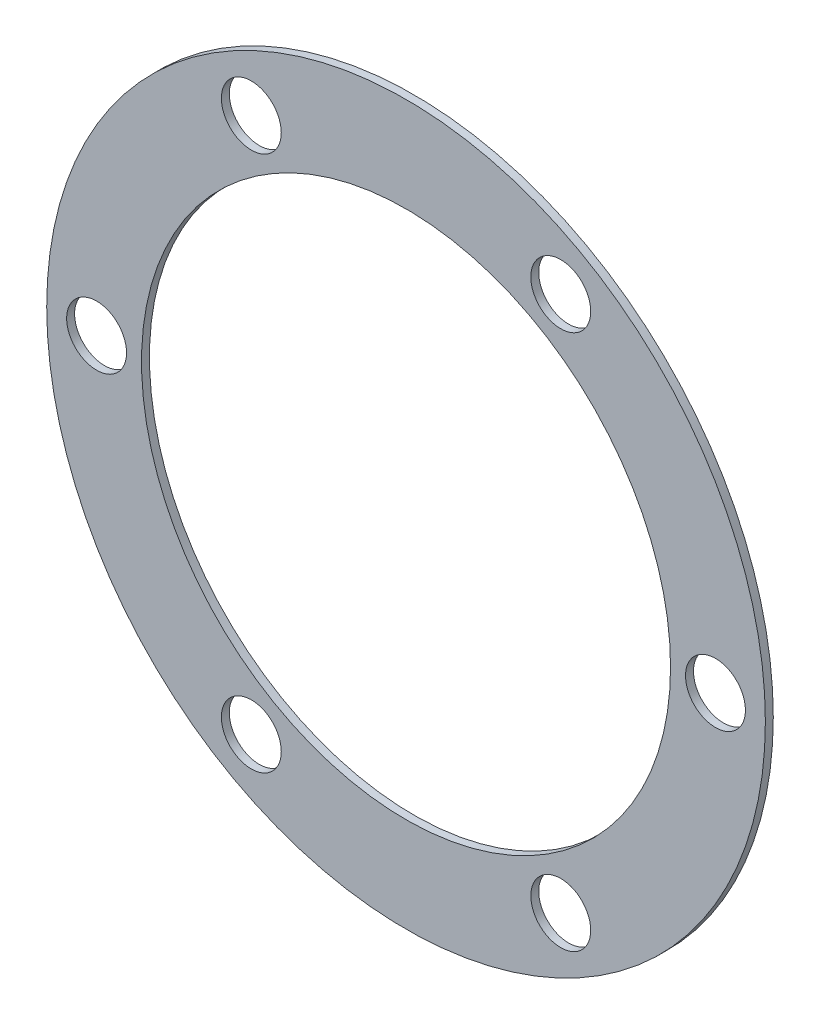
ISO-10303-21;
HEADER;
FILE_DESCRIPTION(('STEP AP214'),'2;1');
FILE_NAME('part.step','',(''),(''),'','','');
FILE_SCHEMA(('AUTOMOTIVE_DESIGN { 1 0 10303 214 1 1 1 1 }'));
ENDSEC;
DATA;
#1=APPLICATION_CONTEXT('core data for automotive mechanical design processes');
#2=APPLICATION_PROTOCOL_DEFINITION('international standard','automotive_design',2000,#1);
#3=PRODUCT_CONTEXT('',#1,'mechanical');
#4=PRODUCT('Part','Part','',(#3));
#5=PRODUCT_RELATED_PRODUCT_CATEGORY('part','',(#4));
#6=PRODUCT_DEFINITION_FORMATION('','',#4);
#7=PRODUCT_DEFINITION_CONTEXT('part definition',#1,'design');
#8=PRODUCT_DEFINITION('design','',#6,#7);
#9=PRODUCT_DEFINITION_SHAPE('','',#8);
#10=(LENGTH_UNIT() NAMED_UNIT(*) SI_UNIT(.MILLI.,.METRE.));
#11=(NAMED_UNIT(*) PLANE_ANGLE_UNIT() SI_UNIT($,.RADIAN.));
#12=(NAMED_UNIT(*) SI_UNIT($,.STERADIAN.) SOLID_ANGLE_UNIT());
#13=UNCERTAINTY_MEASURE_WITH_UNIT(LENGTH_MEASURE(1.E-05),#10,'distance_accuracy_value','');
#14=(GEOMETRIC_REPRESENTATION_CONTEXT(3) GLOBAL_UNCERTAINTY_ASSIGNED_CONTEXT((#13)) GLOBAL_UNIT_ASSIGNED_CONTEXT((#10,
#11,#12)) REPRESENTATION_CONTEXT('',''));
#15=CARTESIAN_POINT('',(0.,0.,0.));
#16=DIRECTION('',(0.,0.,1.));
#17=DIRECTION('',(1.,0.,0.));
#18=AXIS2_PLACEMENT_3D('',#15,#16,#17);
#19=CARTESIAN_POINT('',(0.,0.,0.396875));
#20=DIRECTION('',(0.,0.,-1.));
#21=DIRECTION('',(-1.,0.,0.));
#22=AXIS2_PLACEMENT_3D('',#19,#20,#21);
#23=CYLINDRICAL_SURFACE('',#22,13.25);
#24=CARTESIAN_POINT('',(0.,0.,0.396875));
#25=DIRECTION('',(0.,0.,1.));
#26=DIRECTION('',(1.,0.,0.));
#27=AXIS2_PLACEMENT_3D('',#24,#25,#26);
#28=CIRCLE('',#27,13.25);
#29=CARTESIAN_POINT('',(13.25,0.,0.396875));
#30=VERTEX_POINT('',#29);
#31=EDGE_CURVE('E48',#30,#30,#28,.T.);
#32=ORIENTED_EDGE('',*,*,#31,.T.);
#33=EDGE_LOOP('',(#32));
#34=FACE_BOUND('',#33,.T.);
#35=CARTESIAN_POINT('',(0.,0.,0.));
#36=DIRECTION('',(0.,0.,1.));
#37=DIRECTION('',(1.,0.,0.));
#38=AXIS2_PLACEMENT_3D('',#35,#36,#37);
#39=CIRCLE('',#38,13.25);
#40=CARTESIAN_POINT('',(13.25,0.,0.));
#41=VERTEX_POINT('',#40);
#42=EDGE_CURVE('E81',#41,#41,#39,.T.);
#43=ORIENTED_EDGE('',*,*,#42,.F.);
#44=EDGE_LOOP('',(#43));
#45=FACE_BOUND('',#44,.T.);
#46=ADVANCED_FACE('F39',(#34,#45),#23,.F.);
#47=CARTESIAN_POINT('',(-7.74999999999999,-13.4233937586588,0.396875));
#48=DIRECTION('',(0.,0.,-1.));
#49=DIRECTION('',(-1.,0.,0.));
#50=AXIS2_PLACEMENT_3D('',#47,#48,#49);
#51=CYLINDRICAL_SURFACE('',#50,1.5);
#52=CARTESIAN_POINT('',(-7.74999999999999,-13.4233937586588,0.396875));
#53=DIRECTION('',(0.,0.,1.));
#54=DIRECTION('',(1.,0.,0.));
#55=AXIS2_PLACEMENT_3D('',#52,#53,#54);
#56=CIRCLE('',#55,1.5);
#57=CARTESIAN_POINT('',(-6.24999999999999,-13.4233937586588,0.396875));
#58=VERTEX_POINT('',#57);
#59=EDGE_CURVE('E54',#58,#58,#56,.T.);
#60=ORIENTED_EDGE('',*,*,#59,.T.);
#61=EDGE_LOOP('',(#60));
#62=FACE_BOUND('',#61,.T.);
#63=CARTESIAN_POINT('',(-7.74999999999999,-13.4233937586588,0.));
#64=DIRECTION('',(0.,0.,1.));
#65=DIRECTION('',(1.,0.,0.));
#66=AXIS2_PLACEMENT_3D('',#63,#64,#65);
#67=CIRCLE('',#66,1.5);
#68=CARTESIAN_POINT('',(-6.24999999999999,-13.4233937586588,0.));
#69=VERTEX_POINT('',#68);
#70=EDGE_CURVE('E78',#69,#69,#67,.T.);
#71=ORIENTED_EDGE('',*,*,#70,.F.);
#72=EDGE_LOOP('',(#71));
#73=FACE_BOUND('',#72,.T.);
#74=ADVANCED_FACE('F116',(#62,#73),#51,.F.);
#75=CARTESIAN_POINT('',(7.75000000000001,-13.4233937586588,0.396875));
#76=DIRECTION('',(0.,0.,-1.));
#77=DIRECTION('',(-1.,0.,0.));
#78=AXIS2_PLACEMENT_3D('',#75,#76,#77);
#79=CYLINDRICAL_SURFACE('',#78,1.5);
#80=CARTESIAN_POINT('',(7.75000000000001,-13.4233937586588,0.396875));
#81=DIRECTION('',(0.,0.,1.));
#82=DIRECTION('',(1.,0.,0.));
#83=AXIS2_PLACEMENT_3D('',#80,#81,#82);
#84=CIRCLE('',#83,1.5);
#85=CARTESIAN_POINT('',(9.25000000000001,-13.4233937586588,0.396875));
#86=VERTEX_POINT('',#85);
#87=EDGE_CURVE('E109',#86,#86,#84,.T.);
#88=ORIENTED_EDGE('',*,*,#87,.T.);
#89=EDGE_LOOP('',(#88));
#90=FACE_BOUND('',#89,.T.);
#91=CARTESIAN_POINT('',(7.75000000000001,-13.4233937586588,0.));
#92=DIRECTION('',(0.,0.,1.));
#93=DIRECTION('',(1.,0.,0.));
#94=AXIS2_PLACEMENT_3D('',#91,#92,#93);
#95=CIRCLE('',#94,1.5);
#96=CARTESIAN_POINT('',(9.25000000000001,-13.4233937586588,0.));
#97=VERTEX_POINT('',#96);
#98=EDGE_CURVE('E74',#97,#97,#95,.T.);
#99=ORIENTED_EDGE('',*,*,#98,.F.);
#100=EDGE_LOOP('',(#99));
#101=FACE_BOUND('',#100,.T.);
#102=ADVANCED_FACE('F134',(#90,#101),#79,.F.);
#103=CARTESIAN_POINT('',(15.5,0.,0.396875));
#104=DIRECTION('',(0.,0.,-1.));
#105=DIRECTION('',(-1.,0.,0.));
#106=AXIS2_PLACEMENT_3D('',#103,#104,#105);
#107=CYLINDRICAL_SURFACE('',#106,1.5);
#108=CARTESIAN_POINT('',(15.5,0.,0.396875));
#109=DIRECTION('',(0.,0.,1.));
#110=DIRECTION('',(1.,0.,0.));
#111=AXIS2_PLACEMENT_3D('',#108,#109,#110);
#112=CIRCLE('',#111,1.5);
#113=CARTESIAN_POINT('',(17.,0.,0.396875));
#114=VERTEX_POINT('',#113);
#115=EDGE_CURVE('E105',#114,#114,#112,.T.);
#116=ORIENTED_EDGE('',*,*,#115,.T.);
#117=EDGE_LOOP('',(#116));
#118=FACE_BOUND('',#117,.T.);
#119=CARTESIAN_POINT('',(15.5,0.,0.));
#120=DIRECTION('',(0.,0.,1.));
#121=DIRECTION('',(1.,0.,0.));
#122=AXIS2_PLACEMENT_3D('',#119,#120,#121);
#123=CIRCLE('',#122,1.5);
#124=CARTESIAN_POINT('',(17.,0.,0.));
#125=VERTEX_POINT('',#124);
#126=EDGE_CURVE('E70',#125,#125,#123,.T.);
#127=ORIENTED_EDGE('',*,*,#126,.F.);
#128=EDGE_LOOP('',(#127));
#129=FACE_BOUND('',#128,.T.);
#130=ADVANCED_FACE('F141',(#118,#129),#107,.F.);
#131=CARTESIAN_POINT('',(7.75,13.4233937586588,0.396875));
#132=DIRECTION('',(0.,0.,-1.));
#133=DIRECTION('',(-1.,0.,0.));
#134=AXIS2_PLACEMENT_3D('',#131,#132,#133);
#135=CYLINDRICAL_SURFACE('',#134,1.5);
#136=CARTESIAN_POINT('',(7.75,13.4233937586588,0.396875));
#137=DIRECTION('',(0.,0.,1.));
#138=DIRECTION('',(1.,0.,0.));
#139=AXIS2_PLACEMENT_3D('',#136,#137,#138);
#140=CIRCLE('',#139,1.5);
#141=CARTESIAN_POINT('',(9.25,13.4233937586588,0.396875));
#142=VERTEX_POINT('',#141);
#143=EDGE_CURVE('E99',#142,#142,#140,.T.);
#144=ORIENTED_EDGE('',*,*,#143,.T.);
#145=EDGE_LOOP('',(#144));
#146=FACE_BOUND('',#145,.T.);
#147=CARTESIAN_POINT('',(7.75,13.4233937586588,0.));
#148=DIRECTION('',(0.,0.,1.));
#149=DIRECTION('',(1.,0.,0.));
#150=AXIS2_PLACEMENT_3D('',#147,#148,#149);
#151=CIRCLE('',#150,1.5);
#152=CARTESIAN_POINT('',(9.25,13.4233937586588,0.));
#153=VERTEX_POINT('',#152);
#154=EDGE_CURVE('E66',#153,#153,#151,.T.);
#155=ORIENTED_EDGE('',*,*,#154,.F.);
#156=EDGE_LOOP('',(#155));
#157=FACE_BOUND('',#156,.T.);
#158=ADVANCED_FACE('F145',(#146,#157),#135,.F.);
#159=CARTESIAN_POINT('',(-7.75000000000001,13.4233937586588,0.396875));
#160=DIRECTION('',(0.,0.,-1.));
#161=DIRECTION('',(-1.,0.,0.));
#162=AXIS2_PLACEMENT_3D('',#159,#160,#161);
#163=CYLINDRICAL_SURFACE('',#162,1.5);
#164=CARTESIAN_POINT('',(-7.75000000000001,13.4233937586588,0.396875));
#165=DIRECTION('',(0.,0.,1.));
#166=DIRECTION('',(1.,0.,0.));
#167=AXIS2_PLACEMENT_3D('',#164,#165,#166);
#168=CIRCLE('',#167,1.5);
#169=CARTESIAN_POINT('',(-6.25000000000001,13.4233937586588,0.396875));
#170=VERTEX_POINT('',#169);
#171=EDGE_CURVE('E93',#170,#170,#168,.T.);
#172=ORIENTED_EDGE('',*,*,#171,.T.);
#173=EDGE_LOOP('',(#172));
#174=FACE_BOUND('',#173,.T.);
#175=CARTESIAN_POINT('',(-7.75000000000001,13.4233937586588,0.));
#176=DIRECTION('',(0.,0.,1.));
#177=DIRECTION('',(1.,0.,0.));
#178=AXIS2_PLACEMENT_3D('',#175,#176,#177);
#179=CIRCLE('',#178,1.5);
#180=CARTESIAN_POINT('',(-6.25000000000001,13.4233937586588,0.));
#181=VERTEX_POINT('',#180);
#182=EDGE_CURVE('E62',#181,#181,#179,.T.);
#183=ORIENTED_EDGE('',*,*,#182,.F.);
#184=EDGE_LOOP('',(#183));
#185=FACE_BOUND('',#184,.T.);
#186=ADVANCED_FACE('F148',(#174,#185),#163,.F.);
#187=CARTESIAN_POINT('',(-15.5,0.,0.396875));
#188=DIRECTION('',(0.,0.,-1.));
#189=DIRECTION('',(-1.,0.,0.));
#190=AXIS2_PLACEMENT_3D('',#187,#188,#189);
#191=CYLINDRICAL_SURFACE('',#190,1.5);
#192=CARTESIAN_POINT('',(-15.5,0.,0.396875));
#193=DIRECTION('',(0.,0.,1.));
#194=DIRECTION('',(1.,0.,0.));
#195=AXIS2_PLACEMENT_3D('',#192,#193,#194);
#196=CIRCLE('',#195,1.5);
#197=CARTESIAN_POINT('',(-14.,0.,0.396875));
#198=VERTEX_POINT('',#197);
#199=EDGE_CURVE('E88',#198,#198,#196,.T.);
#200=ORIENTED_EDGE('',*,*,#199,.T.);
#201=EDGE_LOOP('',(#200));
#202=FACE_BOUND('',#201,.T.);
#203=CARTESIAN_POINT('',(-15.5,0.,0.));
#204=DIRECTION('',(0.,0.,1.));
#205=DIRECTION('',(1.,0.,0.));
#206=AXIS2_PLACEMENT_3D('',#203,#204,#205);
#207=CIRCLE('',#206,1.5);
#208=CARTESIAN_POINT('',(-14.,0.,0.));
#209=VERTEX_POINT('',#208);
#210=EDGE_CURVE('E58',#209,#209,#207,.T.);
#211=ORIENTED_EDGE('',*,*,#210,.F.);
#212=EDGE_LOOP('',(#211));
#213=FACE_BOUND('',#212,.T.);
#214=ADVANCED_FACE('F41',(#202,#213),#191,.F.);
#215=CARTESIAN_POINT('',(0.,0.,0.396875));
#216=DIRECTION('',(0.,0.,-1.));
#217=DIRECTION('',(-1.,0.,0.));
#218=AXIS2_PLACEMENT_3D('',#215,#216,#217);
#219=CYLINDRICAL_SURFACE('',#218,18.);
#220=CARTESIAN_POINT('',(0.,0.,0.396875));
#221=DIRECTION('',(0.,0.,1.));
#222=DIRECTION('',(1.,0.,0.));
#223=AXIS2_PLACEMENT_3D('',#220,#221,#222);
#224=CIRCLE('',#223,18.);
#225=CARTESIAN_POINT('',(18.,0.,0.396875));
#226=VERTEX_POINT('',#225);
#227=EDGE_CURVE('E10',#226,#226,#224,.T.);
#228=ORIENTED_EDGE('',*,*,#227,.F.);
#229=EDGE_LOOP('',(#228));
#230=FACE_BOUND('',#229,.T.);
#231=CARTESIAN_POINT('',(0.,0.,0.));
#232=DIRECTION('',(0.,0.,1.));
#233=DIRECTION('',(1.,0.,0.));
#234=AXIS2_PLACEMENT_3D('',#231,#232,#233);
#235=CIRCLE('',#234,18.);
#236=CARTESIAN_POINT('',(18.,0.,0.));
#237=VERTEX_POINT('',#236);
#238=EDGE_CURVE('E43',#237,#237,#235,.T.);
#239=ORIENTED_EDGE('',*,*,#238,.T.);
#240=EDGE_LOOP('',(#239));
#241=FACE_BOUND('',#240,.T.);
#242=ADVANCED_FACE('F123',(#230,#241),#219,.T.);
#243=CARTESIAN_POINT('',(0.,0.,0.396875));
#244=DIRECTION('',(0.,0.,1.));
#245=DIRECTION('',(1.,0.,0.));
#246=AXIS2_PLACEMENT_3D('',#243,#244,#245);
#247=PLANE('',#246);
#248=ORIENTED_EDGE('',*,*,#199,.F.);
#249=EDGE_LOOP('',(#248));
#250=FACE_BOUND('',#249,.T.);
#251=ORIENTED_EDGE('',*,*,#171,.F.);
#252=EDGE_LOOP('',(#251));
#253=FACE_BOUND('',#252,.T.);
#254=ORIENTED_EDGE('',*,*,#143,.F.);
#255=EDGE_LOOP('',(#254));
#256=FACE_BOUND('',#255,.T.);
#257=ORIENTED_EDGE('',*,*,#115,.F.);
#258=EDGE_LOOP('',(#257));
#259=FACE_BOUND('',#258,.T.);
#260=ORIENTED_EDGE('',*,*,#87,.F.);
#261=EDGE_LOOP('',(#260));
#262=FACE_BOUND('',#261,.T.);
#263=ORIENTED_EDGE('',*,*,#59,.F.);
#264=EDGE_LOOP('',(#263));
#265=FACE_BOUND('',#264,.T.);
#266=ORIENTED_EDGE('',*,*,#31,.F.);
#267=EDGE_LOOP('',(#266));
#268=FACE_BOUND('',#267,.T.);
#269=ORIENTED_EDGE('',*,*,#227,.T.);
#270=EDGE_LOOP('',(#269));
#271=FACE_BOUND('',#270,.T.);
#272=ADVANCED_FACE('F119',(#250,#253,#256,#259,#262,#265,#268,#271),#247,.T.);
#273=CARTESIAN_POINT('',(0.,0.,0.));
#274=DIRECTION('',(0.,0.,1.));
#275=DIRECTION('',(1.,0.,0.));
#276=AXIS2_PLACEMENT_3D('',#273,#274,#275);
#277=PLANE('',#276);
#278=ORIENTED_EDGE('',*,*,#210,.T.);
#279=EDGE_LOOP('',(#278));
#280=FACE_BOUND('',#279,.T.);
#281=ORIENTED_EDGE('',*,*,#182,.T.);
#282=EDGE_LOOP('',(#281));
#283=FACE_BOUND('',#282,.T.);
#284=ORIENTED_EDGE('',*,*,#154,.T.);
#285=EDGE_LOOP('',(#284));
#286=FACE_BOUND('',#285,.T.);
#287=ORIENTED_EDGE('',*,*,#126,.T.);
#288=EDGE_LOOP('',(#287));
#289=FACE_BOUND('',#288,.T.);
#290=ORIENTED_EDGE('',*,*,#98,.T.);
#291=EDGE_LOOP('',(#290));
#292=FACE_BOUND('',#291,.T.);
#293=ORIENTED_EDGE('',*,*,#70,.T.);
#294=EDGE_LOOP('',(#293));
#295=FACE_BOUND('',#294,.T.);
#296=ORIENTED_EDGE('',*,*,#42,.T.);
#297=EDGE_LOOP('',(#296));
#298=FACE_BOUND('',#297,.T.);
#299=ORIENTED_EDGE('',*,*,#238,.F.);
#300=EDGE_LOOP('',(#299));
#301=FACE_BOUND('',#300,.T.);
#302=ADVANCED_FACE('F122',(#280,#283,#286,#289,#292,#295,#298,#301),#277,.F.);
#303=CLOSED_SHELL('',(#46,#74,#102,#130,#158,#186,#214,#242,#272,#302));
#304=MANIFOLD_SOLID_BREP('B2',#303);
#305=ADVANCED_BREP_SHAPE_REPRESENTATION('',(#18,#304),#14);
#306=SHAPE_DEFINITION_REPRESENTATION(#9,#305);
ENDSEC;
END-ISO-10303-21;
